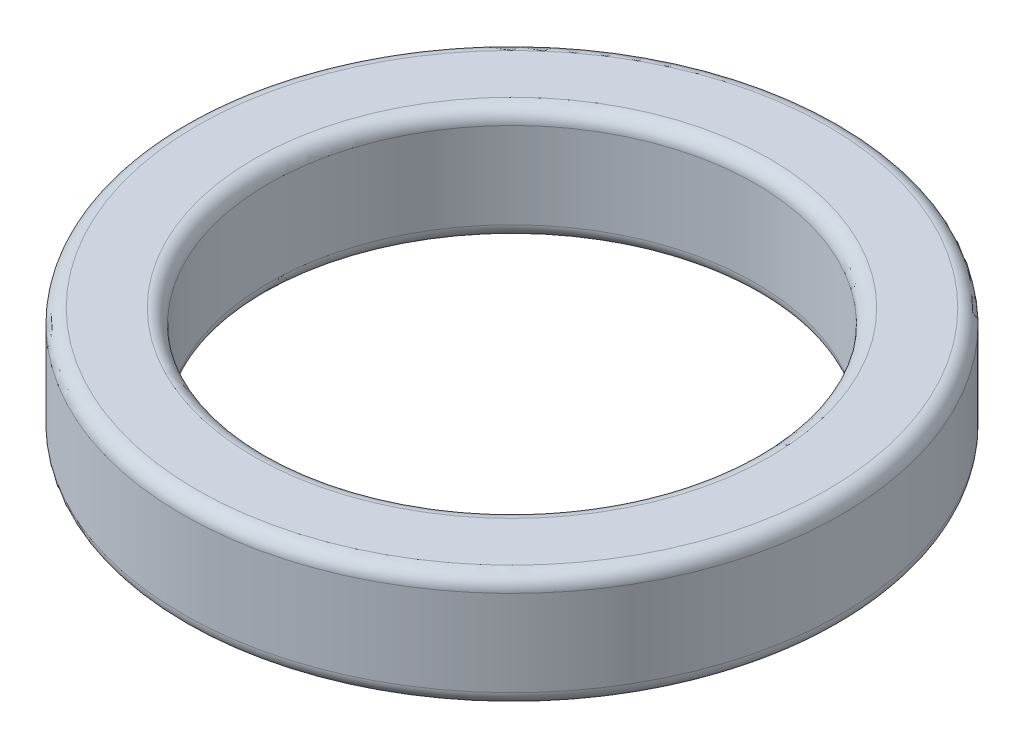
ISO-10303-21;
HEADER;
FILE_DESCRIPTION(('STEP AP214'),'2;1');
FILE_NAME('part.step','',(''),(''),'','','');
FILE_SCHEMA(('AUTOMOTIVE_DESIGN { 1 0 10303 214 1 1 1 1 }'));
ENDSEC;
DATA;
#1=APPLICATION_CONTEXT('core data for automotive mechanical design processes');
#2=APPLICATION_PROTOCOL_DEFINITION('international standard','automotive_design',2000,#1);
#3=PRODUCT_CONTEXT('',#1,'mechanical');
#4=PRODUCT('Part','Part','',(#3));
#5=PRODUCT_RELATED_PRODUCT_CATEGORY('part','',(#4));
#6=PRODUCT_DEFINITION_FORMATION('','',#4);
#7=PRODUCT_DEFINITION_CONTEXT('part definition',#1,'design');
#8=PRODUCT_DEFINITION('design','',#6,#7);
#9=PRODUCT_DEFINITION_SHAPE('','',#8);
#10=(LENGTH_UNIT() NAMED_UNIT(*) SI_UNIT(.MILLI.,.METRE.));
#11=(NAMED_UNIT(*) PLANE_ANGLE_UNIT() SI_UNIT($,.RADIAN.));
#12=(NAMED_UNIT(*) SI_UNIT($,.STERADIAN.) SOLID_ANGLE_UNIT());
#13=UNCERTAINTY_MEASURE_WITH_UNIT(LENGTH_MEASURE(1.E-05),#10,'distance_accuracy_value','');
#14=(GEOMETRIC_REPRESENTATION_CONTEXT(3) GLOBAL_UNCERTAINTY_ASSIGNED_CONTEXT((#13)) GLOBAL_UNIT_ASSIGNED_CONTEXT((#10,
#11,#12)) REPRESENTATION_CONTEXT('',''));
#15=CARTESIAN_POINT('',(0.,0.,0.));
#16=DIRECTION('',(0.,0.,1.));
#17=DIRECTION('',(1.,0.,0.));
#18=AXIS2_PLACEMENT_3D('',#15,#16,#17);
#19=CARTESIAN_POINT('',(0.,4.,0.));
#20=DIRECTION('',(0.,1.,0.));
#21=DIRECTION('',(0.,0.,1.));
#22=AXIS2_PLACEMENT_3D('',#19,#20,#21);
#23=PLANE('',#22);
#24=CARTESIAN_POINT('',(0.,4.,0.));
#25=DIRECTION('',(0.,1.,0.));
#26=DIRECTION('',(0.,0.,1.));
#27=AXIS2_PLACEMENT_3D('',#24,#25,#26);
#28=CIRCLE('',#27,9.);
#29=CARTESIAN_POINT('',(0.,4.,9.));
#30=VERTEX_POINT('',#29);
#31=EDGE_CURVE('E10',#30,#30,#28,.F.);
#32=ORIENTED_EDGE('',*,*,#31,.T.);
#33=EDGE_LOOP('',(#32));
#34=FACE_BOUND('',#33,.T.);
#35=CARTESIAN_POINT('',(0.,4.,0.));
#36=DIRECTION('',(0.,1.,0.));
#37=DIRECTION('',(0.,0.,1.));
#38=AXIS2_PLACEMENT_3D('',#35,#36,#37);
#39=CIRCLE('',#38,11.);
#40=CARTESIAN_POINT('',(0.,4.,11.));
#41=VERTEX_POINT('',#40);
#42=EDGE_CURVE('E39',#41,#41,#39,.T.);
#43=ORIENTED_EDGE('',*,*,#42,.T.);
#44=EDGE_LOOP('',(#43));
#45=FACE_BOUND('',#44,.T.);
#46=ADVANCED_FACE('F32',(#34,#45),#23,.T.);
#47=CARTESIAN_POINT('',(0.,0.,0.));
#48=DIRECTION('',(0.,1.,0.));
#49=DIRECTION('',(0.,0.,1.));
#50=AXIS2_PLACEMENT_3D('',#47,#48,#49);
#51=PLANE('',#50);
#52=CARTESIAN_POINT('',(0.,0.,0.));
#53=DIRECTION('',(0.,1.,0.));
#54=DIRECTION('',(0.,0.,1.));
#55=AXIS2_PLACEMENT_3D('',#52,#53,#54);
#56=CIRCLE('',#55,11.);
#57=CARTESIAN_POINT('',(0.,0.,11.));
#58=VERTEX_POINT('',#57);
#59=EDGE_CURVE('E52',#58,#58,#56,.F.);
#60=ORIENTED_EDGE('',*,*,#59,.T.);
#61=EDGE_LOOP('',(#60));
#62=FACE_BOUND('',#61,.T.);
#63=CARTESIAN_POINT('',(0.,0.,0.));
#64=DIRECTION('',(0.,1.,0.));
#65=DIRECTION('',(0.,0.,1.));
#66=AXIS2_PLACEMENT_3D('',#63,#64,#65);
#67=CIRCLE('',#66,9.);
#68=CARTESIAN_POINT('',(0.,0.,9.));
#69=VERTEX_POINT('',#68);
#70=EDGE_CURVE('E55',#69,#69,#67,.T.);
#71=ORIENTED_EDGE('',*,*,#70,.T.);
#72=EDGE_LOOP('',(#71));
#73=FACE_BOUND('',#72,.T.);
#74=ADVANCED_FACE('F76',(#62,#73),#51,.F.);
#75=CARTESIAN_POINT('',(0.,4.,0.));
#76=DIRECTION('',(0.,-1.,0.));
#77=DIRECTION('',(0.,0.,-1.));
#78=AXIS2_PLACEMENT_3D('',#75,#76,#77);
#79=CYLINDRICAL_SURFACE('',#78,11.5);
#80=CARTESIAN_POINT('',(0.,0.5,0.));
#81=DIRECTION('',(0.,1.,0.));
#82=DIRECTION('',(0.,0.,1.));
#83=AXIS2_PLACEMENT_3D('',#80,#81,#82);
#84=CIRCLE('',#83,11.5);
#85=CARTESIAN_POINT('',(0.,0.5,11.5));
#86=VERTEX_POINT('',#85);
#87=EDGE_CURVE('E58',#86,#86,#84,.T.);
#88=ORIENTED_EDGE('',*,*,#87,.T.);
#89=EDGE_LOOP('',(#88));
#90=FACE_BOUND('',#89,.T.);
#91=CARTESIAN_POINT('',(0.,3.5,0.));
#92=DIRECTION('',(0.,1.,0.));
#93=DIRECTION('',(0.,0.,1.));
#94=AXIS2_PLACEMENT_3D('',#91,#92,#93);
#95=CIRCLE('',#94,11.5);
#96=CARTESIAN_POINT('',(0.,3.5,11.5));
#97=VERTEX_POINT('',#96);
#98=EDGE_CURVE('E61',#97,#97,#95,.F.);
#99=ORIENTED_EDGE('',*,*,#98,.T.);
#100=EDGE_LOOP('',(#99));
#101=FACE_BOUND('',#100,.T.);
#102=ADVANCED_FACE('F65',(#90,#101),#79,.T.);
#103=CARTESIAN_POINT('',(0.,4.,0.));
#104=DIRECTION('',(0.,-1.,0.));
#105=DIRECTION('',(0.,0.,-1.));
#106=AXIS2_PLACEMENT_3D('',#103,#104,#105);
#107=CYLINDRICAL_SURFACE('',#106,8.5);
#108=CARTESIAN_POINT('',(0.,0.5,0.));
#109=DIRECTION('',(0.,1.,0.));
#110=DIRECTION('',(0.,0.,1.));
#111=AXIS2_PLACEMENT_3D('',#108,#109,#110);
#112=CIRCLE('',#111,8.5);
#113=CARTESIAN_POINT('',(0.,0.5,8.5));
#114=VERTEX_POINT('',#113);
#115=EDGE_CURVE('E43',#114,#114,#112,.F.);
#116=ORIENTED_EDGE('',*,*,#115,.T.);
#117=EDGE_LOOP('',(#116));
#118=FACE_BOUND('',#117,.T.);
#119=CARTESIAN_POINT('',(0.,3.5,0.));
#120=DIRECTION('',(0.,1.,0.));
#121=DIRECTION('',(0.,0.,1.));
#122=AXIS2_PLACEMENT_3D('',#119,#120,#121);
#123=CIRCLE('',#122,8.5);
#124=CARTESIAN_POINT('',(0.,3.5,8.5));
#125=VERTEX_POINT('',#124);
#126=EDGE_CURVE('E47',#125,#125,#123,.T.);
#127=ORIENTED_EDGE('',*,*,#126,.T.);
#128=EDGE_LOOP('',(#127));
#129=FACE_BOUND('',#128,.T.);
#130=ADVANCED_FACE('F84',(#118,#129),#107,.F.);
#131=CARTESIAN_POINT('',(0.,0.5,0.));
#132=DIRECTION('',(0.,1.,0.));
#133=DIRECTION('',(0.,0.,1.));
#134=AXIS2_PLACEMENT_3D('',#131,#132,#133);
#135=TOROIDAL_SURFACE('',#134,11.,0.5);
#136=ORIENTED_EDGE('',*,*,#59,.F.);
#137=EDGE_LOOP('',(#136));
#138=FACE_BOUND('',#137,.T.);
#139=ORIENTED_EDGE('',*,*,#87,.F.);
#140=EDGE_LOOP('',(#139));
#141=FACE_BOUND('',#140,.T.);
#142=ADVANCED_FACE('F89',(#138,#141),#135,.T.);
#143=CARTESIAN_POINT('',(0.,0.5,0.));
#144=DIRECTION('',(0.,1.,0.));
#145=DIRECTION('',(0.,0.,1.));
#146=AXIS2_PLACEMENT_3D('',#143,#144,#145);
#147=TOROIDAL_SURFACE('',#146,9.,0.5);
#148=ORIENTED_EDGE('',*,*,#115,.F.);
#149=EDGE_LOOP('',(#148));
#150=FACE_BOUND('',#149,.T.);
#151=ORIENTED_EDGE('',*,*,#70,.F.);
#152=EDGE_LOOP('',(#151));
#153=FACE_BOUND('',#152,.T.);
#154=ADVANCED_FACE('F73',(#150,#153),#147,.T.);
#155=CARTESIAN_POINT('',(0.,3.5,0.));
#156=DIRECTION('',(0.,1.,0.));
#157=DIRECTION('',(0.,0.,1.));
#158=AXIS2_PLACEMENT_3D('',#155,#156,#157);
#159=TOROIDAL_SURFACE('',#158,9.,0.5);
#160=ORIENTED_EDGE('',*,*,#31,.F.);
#161=EDGE_LOOP('',(#160));
#162=FACE_BOUND('',#161,.T.);
#163=ORIENTED_EDGE('',*,*,#126,.F.);
#164=EDGE_LOOP('',(#163));
#165=FACE_BOUND('',#164,.T.);
#166=ADVANCED_FACE('F69',(#162,#165),#159,.T.);
#167=CARTESIAN_POINT('',(0.,3.5,0.));
#168=DIRECTION('',(0.,1.,0.));
#169=DIRECTION('',(0.,0.,1.));
#170=AXIS2_PLACEMENT_3D('',#167,#168,#169);
#171=TOROIDAL_SURFACE('',#170,11.,0.5);
#172=ORIENTED_EDGE('',*,*,#98,.F.);
#173=EDGE_LOOP('',(#172));
#174=FACE_BOUND('',#173,.T.);
#175=ORIENTED_EDGE('',*,*,#42,.F.);
#176=EDGE_LOOP('',(#175));
#177=FACE_BOUND('',#176,.T.);
#178=ADVANCED_FACE('F34',(#174,#177),#171,.T.);
#179=CLOSED_SHELL('',(#46,#74,#102,#130,#142,#154,#166,#178));
#180=MANIFOLD_SOLID_BREP('B2',#179);
#181=ADVANCED_BREP_SHAPE_REPRESENTATION('',(#18,#180),#14);
#182=SHAPE_DEFINITION_REPRESENTATION(#9,#181);
ENDSEC;
END-ISO-10303-21;
